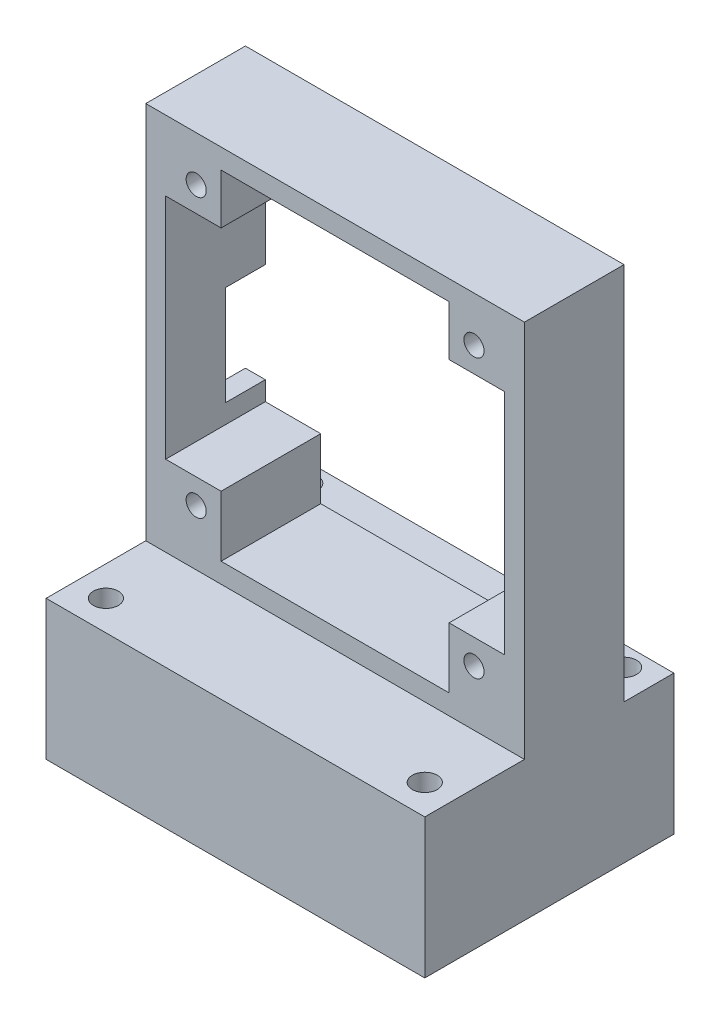
ISO-10303-21;
HEADER;
FILE_DESCRIPTION(('STEP AP214'),'2;1');
FILE_NAME('part.step','',(''),(''),'','','');
FILE_SCHEMA(('AUTOMOTIVE_DESIGN { 1 0 10303 214 1 1 1 1 }'));
ENDSEC;
DATA;
#1=APPLICATION_CONTEXT('core data for automotive mechanical design processes');
#2=APPLICATION_PROTOCOL_DEFINITION('international standard','automotive_design',2000,#1);
#3=PRODUCT_CONTEXT('',#1,'mechanical');
#4=PRODUCT('Part','Part','',(#3));
#5=PRODUCT_RELATED_PRODUCT_CATEGORY('part','',(#4));
#6=PRODUCT_DEFINITION_FORMATION('','',#4);
#7=PRODUCT_DEFINITION_CONTEXT('part definition',#1,'design');
#8=PRODUCT_DEFINITION('design','',#6,#7);
#9=PRODUCT_DEFINITION_SHAPE('','',#8);
#10=(LENGTH_UNIT() NAMED_UNIT(*) SI_UNIT(.MILLI.,.METRE.));
#11=(NAMED_UNIT(*) PLANE_ANGLE_UNIT() SI_UNIT($,.RADIAN.));
#12=(NAMED_UNIT(*) SI_UNIT($,.STERADIAN.) SOLID_ANGLE_UNIT());
#13=UNCERTAINTY_MEASURE_WITH_UNIT(LENGTH_MEASURE(1.E-05),#10,'distance_accuracy_value','');
#14=(GEOMETRIC_REPRESENTATION_CONTEXT(3) GLOBAL_UNCERTAINTY_ASSIGNED_CONTEXT((#13)) GLOBAL_UNIT_ASSIGNED_CONTEXT((#10,
#11,#12)) REPRESENTATION_CONTEXT('',''));
#15=CARTESIAN_POINT('',(0.,0.,0.));
#16=DIRECTION('',(0.,0.,1.));
#17=DIRECTION('',(1.,0.,0.));
#18=AXIS2_PLACEMENT_3D('',#15,#16,#17);
#19=CARTESIAN_POINT('',(0.,14.,0.));
#20=DIRECTION('',(0.,1.,0.));
#21=DIRECTION('',(0.,0.,1.));
#22=AXIS2_PLACEMENT_3D('',#19,#20,#21);
#23=PLANE('',#22);
#24=DIRECTION('',(1.,0.,0.));
#25=VECTOR('',#24,1.);
#26=CARTESIAN_POINT('',(-16.2857142857143,14.,-11.989417989418));
#27=LINE('',#26,#25);
#28=CARTESIAN_POINT('',(-16.2857142857143,14.,-11.989417989418));
#29=VERTEX_POINT('',#28);
#30=CARTESIAN_POINT('',(21.7142857142857,14.,-11.989417989418));
#31=VERTEX_POINT('',#30);
#32=EDGE_CURVE('E201',#29,#31,#27,.T.);
#33=ORIENTED_EDGE('',*,*,#32,.F.);
#34=DIRECTION('',(0.,0.,1.));
#35=VECTOR('',#34,1.);
#36=CARTESIAN_POINT('',(-16.2857142857143,14.,-16.989417989418));
#37=LINE('',#36,#35);
#38=CARTESIAN_POINT('',(-16.2857142857143,14.,-6.98941798941799));
#39=VERTEX_POINT('',#38);
#40=EDGE_CURVE('E210',#29,#39,#37,.T.);
#41=ORIENTED_EDGE('',*,*,#40,.T.);
#42=DIRECTION('',(-1.,0.,0.));
#43=VECTOR('',#42,1.);
#44=CARTESIAN_POINT('',(-16.2857142857142,14.,-6.98941798941799));
#45=LINE('',#44,#43);
#46=CARTESIAN_POINT('',(21.7142857142857,14.,-6.98941798941799));
#47=VERTEX_POINT('',#46);
#48=EDGE_CURVE('E478',#47,#39,#45,.T.);
#49=ORIENTED_EDGE('',*,*,#48,.F.);
#50=DIRECTION('',(0.,0.,-1.));
#51=VECTOR('',#50,1.);
#52=CARTESIAN_POINT('',(21.7142857142857,14.,-16.989417989418));
#53=LINE('',#52,#51);
#54=EDGE_CURVE('E213',#47,#31,#53,.T.);
#55=ORIENTED_EDGE('',*,*,#54,.T.);
#56=EDGE_LOOP('',(#33,#41,#49,#55));
#57=FACE_BOUND('',#56,.T.);
#58=CARTESIAN_POINT('',(18.7142857142857,14.,-9.98941798941799));
#59=DIRECTION('',(0.,1.,0.));
#60=DIRECTION('',(0.,0.,1.));
#61=AXIS2_PLACEMENT_3D('',#58,#59,#60);
#62=CIRCLE('',#61,1.25);
#63=CARTESIAN_POINT('',(18.7142857142857,14.,-8.73941798941799));
#64=VERTEX_POINT('',#63);
#65=EDGE_CURVE('E685',#64,#64,#62,.T.);
#66=ORIENTED_EDGE('',*,*,#65,.F.);
#67=EDGE_LOOP('',(#66));
#68=FACE_BOUND('',#67,.T.);
#69=CARTESIAN_POINT('',(-13.2857142857143,14.,-9.98941798941799));
#70=DIRECTION('',(0.,1.,0.));
#71=DIRECTION('',(0.,0.,1.));
#72=AXIS2_PLACEMENT_3D('',#69,#70,#71);
#73=CIRCLE('',#72,1.25);
#74=CARTESIAN_POINT('',(-13.2857142857143,14.,-8.73941798941799));
#75=VERTEX_POINT('',#74);
#76=EDGE_CURVE('E268',#75,#75,#73,.T.);
#77=ORIENTED_EDGE('',*,*,#76,.F.);
#78=EDGE_LOOP('',(#77));
#79=FACE_BOUND('',#78,.T.);
#80=ADVANCED_FACE('F39',(#57,#68,#79),#23,.T.);
#81=CARTESIAN_POINT('',(-16.2857142857143,14.,-16.989417989418));
#82=DIRECTION('',(1.,0.,0.));
#83=DIRECTION('',(0.,0.,-1.));
#84=AXIS2_PLACEMENT_3D('',#81,#82,#83);
#85=PLANE('',#84);
#86=ORIENTED_EDGE('',*,*,#40,.F.);
#87=DIRECTION('',(0.,1.,0.));
#88=VECTOR('',#87,1.);
#89=CARTESIAN_POINT('',(-16.2857142857143,-17.,-11.989417989418));
#90=LINE('',#89,#88);
#91=CARTESIAN_POINT('',(-16.2857142857143,0.,-11.989417989418));
#92=VERTEX_POINT('',#91);
#93=EDGE_CURVE('E198',#92,#29,#90,.T.);
#94=ORIENTED_EDGE('',*,*,#93,.F.);
#95=DIRECTION('',(0.,0.,1.));
#96=VECTOR('',#95,1.);
#97=CARTESIAN_POINT('',(-16.2857142857143,0.,-16.989417989418));
#98=LINE('',#97,#96);
#99=CARTESIAN_POINT('',(-16.2857142857143,0.,13.010582010582));
#100=VERTEX_POINT('',#99);
#101=EDGE_CURVE('E236',#92,#100,#98,.T.);
#102=ORIENTED_EDGE('',*,*,#101,.T.);
#103=DIRECTION('',(0.,-1.,0.));
#104=VECTOR('',#103,1.);
#105=CARTESIAN_POINT('',(-16.2857142857143,14.,13.010582010582));
#106=LINE('',#105,#104);
#107=CARTESIAN_POINT('',(-16.2857142857143,14.,13.010582010582));
#108=VERTEX_POINT('',#107);
#109=EDGE_CURVE('E248',#108,#100,#106,.T.);
#110=ORIENTED_EDGE('',*,*,#109,.F.);
#111=CARTESIAN_POINT('',(-16.2857142857143,14.,3.01058201058201));
#112=VERTEX_POINT('',#111);
#113=EDGE_CURVE('E222',#112,#108,#37,.T.);
#114=ORIENTED_EDGE('',*,*,#113,.F.);
#115=DIRECTION('',(0.,-1.,0.));
#116=VECTOR('',#115,1.);
#117=CARTESIAN_POINT('',(-16.2857142857143,52.,3.01058201058201));
#118=LINE('',#117,#116);
#119=CARTESIAN_POINT('',(-16.2857142857143,52.,3.01058201058201));
#120=VERTEX_POINT('',#119);
#121=EDGE_CURVE('E229',#120,#112,#118,.T.);
#122=ORIENTED_EDGE('',*,*,#121,.F.);
#123=DIRECTION('',(0.,0.,1.));
#124=VECTOR('',#123,1.);
#125=CARTESIAN_POINT('',(-16.2857142857142,52.,-6.98941798941799));
#126=LINE('',#125,#124);
#127=CARTESIAN_POINT('',(-16.2857142857142,52.,-6.98941798941799));
#128=VERTEX_POINT('',#127);
#129=EDGE_CURVE('E473',#128,#120,#126,.T.);
#130=ORIENTED_EDGE('',*,*,#129,.F.);
#131=DIRECTION('',(0.,-1.,0.));
#132=VECTOR('',#131,1.);
#133=CARTESIAN_POINT('',(-16.2857142857142,52.,-6.98941798941799));
#134=LINE('',#133,#132);
#135=CARTESIAN_POINT('',(-16.2857142857143,34.,-6.98941798941799));
#136=VERTEX_POINT('',#135);
#137=EDGE_CURVE('E492',#128,#136,#134,.T.);
#138=ORIENTED_EDGE('',*,*,#137,.T.);
#139=DIRECTION('',(0.,0.,-1.));
#140=VECTOR('',#139,1.);
#141=CARTESIAN_POINT('',(-16.2857142857143,34.,-6.98941798941799));
#142=LINE('',#141,#140);
#143=CARTESIAN_POINT('',(-16.2857142857143,34.,-2.98941798941799));
#144=VERTEX_POINT('',#143);
#145=EDGE_CURVE('E287',#144,#136,#142,.T.);
#146=ORIENTED_EDGE('',*,*,#145,.F.);
#147=DIRECTION('',(0.,1.,0.));
#148=VECTOR('',#147,1.);
#149=CARTESIAN_POINT('',(-16.2857142857143,34.,-2.98941798941799));
#150=LINE('',#149,#148);
#151=CARTESIAN_POINT('',(-16.2857142857143,24.,-2.98941798941799));
#152=VERTEX_POINT('',#151);
#153=EDGE_CURVE('E282',#152,#144,#150,.T.);
#154=ORIENTED_EDGE('',*,*,#153,.F.);
#155=DIRECTION('',(0.,0.,1.));
#156=VECTOR('',#155,1.);
#157=CARTESIAN_POINT('',(-16.2857142857143,24.,-6.98941798941799));
#158=LINE('',#157,#156);
#159=CARTESIAN_POINT('',(-16.2857142857143,24.,-6.98941798941799));
#160=VERTEX_POINT('',#159);
#161=EDGE_CURVE('E278',#160,#152,#158,.T.);
#162=ORIENTED_EDGE('',*,*,#161,.F.);
#163=EDGE_CURVE('E218',#160,#39,#134,.T.);
#164=ORIENTED_EDGE('',*,*,#163,.T.);
#165=EDGE_LOOP('',(#86,#94,#102,#110,#114,#122,#130,#138,#146,#154,#162,#164));
#166=FACE_BOUND('',#165,.T.);
#167=ADVANCED_FACE('F41',(#166),#85,.F.);
#168=CARTESIAN_POINT('',(-16.2857142857143,14.,13.010582010582));
#169=DIRECTION('',(0.,0.,-1.));
#170=DIRECTION('',(-1.,0.,0.));
#171=AXIS2_PLACEMENT_3D('',#168,#169,#170);
#172=PLANE('',#171);
#173=DIRECTION('',(1.,0.,0.));
#174=VECTOR('',#173,1.);
#175=CARTESIAN_POINT('',(-16.2857142857143,0.,13.010582010582));
#176=LINE('',#175,#174);
#177=CARTESIAN_POINT('',(21.7142857142857,0.,13.010582010582));
#178=VERTEX_POINT('',#177);
#179=EDGE_CURVE('E239',#100,#178,#176,.T.);
#180=ORIENTED_EDGE('',*,*,#179,.T.);
#181=DIRECTION('',(0.,-1.,0.));
#182=VECTOR('',#181,1.);
#183=CARTESIAN_POINT('',(21.7142857142857,14.,13.010582010582));
#184=LINE('',#183,#182);
#185=CARTESIAN_POINT('',(21.7142857142857,14.,13.010582010582));
#186=VERTEX_POINT('',#185);
#187=EDGE_CURVE('E235',#186,#178,#184,.T.);
#188=ORIENTED_EDGE('',*,*,#187,.F.);
#189=DIRECTION('',(1.,0.,0.));
#190=VECTOR('',#189,1.);
#191=CARTESIAN_POINT('',(-16.2857142857143,14.,13.010582010582));
#192=LINE('',#191,#190);
#193=EDGE_CURVE('E221',#108,#186,#192,.T.);
#194=ORIENTED_EDGE('',*,*,#193,.F.);
#195=ORIENTED_EDGE('',*,*,#109,.T.);
#196=EDGE_LOOP('',(#180,#188,#194,#195));
#197=FACE_BOUND('',#196,.T.);
#198=ADVANCED_FACE('F519',(#197),#172,.F.);
#199=CARTESIAN_POINT('',(21.7142857142857,14.,-16.989417989418));
#200=DIRECTION('',(-1.,0.,0.));
#201=DIRECTION('',(0.,0.,1.));
#202=AXIS2_PLACEMENT_3D('',#199,#200,#201);
#203=PLANE('',#202);
#204=DIRECTION('',(0.,0.,-1.));
#205=VECTOR('',#204,1.);
#206=CARTESIAN_POINT('',(21.7142857142857,0.,-16.989417989418));
#207=LINE('',#206,#205);
#208=CARTESIAN_POINT('',(21.7142857142857,0.,-11.989417989418));
#209=VERTEX_POINT('',#208);
#210=EDGE_CURVE('E227',#178,#209,#207,.T.);
#211=ORIENTED_EDGE('',*,*,#210,.T.);
#212=DIRECTION('',(0.,1.,0.));
#213=VECTOR('',#212,1.);
#214=CARTESIAN_POINT('',(21.7142857142857,-17.,-11.989417989418));
#215=LINE('',#214,#213);
#216=EDGE_CURVE('E55',#209,#31,#215,.T.);
#217=ORIENTED_EDGE('',*,*,#216,.T.);
#218=ORIENTED_EDGE('',*,*,#54,.F.);
#219=DIRECTION('',(0.,-1.,0.));
#220=VECTOR('',#219,1.);
#221=CARTESIAN_POINT('',(21.7142857142857,52.,-6.98941798941799));
#222=LINE('',#221,#220);
#223=CARTESIAN_POINT('',(21.7142857142857,52.,-6.98941798941799));
#224=VERTEX_POINT('',#223);
#225=EDGE_CURVE('E496',#224,#47,#222,.T.);
#226=ORIENTED_EDGE('',*,*,#225,.F.);
#227=DIRECTION('',(0.,0.,-1.));
#228=VECTOR('',#227,1.);
#229=CARTESIAN_POINT('',(21.7142857142857,52.,-6.98941798941799));
#230=LINE('',#229,#228);
#231=CARTESIAN_POINT('',(21.7142857142857,52.,3.01058201058201));
#232=VERTEX_POINT('',#231);
#233=EDGE_CURVE('E481',#232,#224,#230,.T.);
#234=ORIENTED_EDGE('',*,*,#233,.F.);
#235=DIRECTION('',(0.,-1.,0.));
#236=VECTOR('',#235,1.);
#237=CARTESIAN_POINT('',(21.7142857142857,52.,3.01058201058201));
#238=LINE('',#237,#236);
#239=CARTESIAN_POINT('',(21.7142857142857,14.,3.01058201058201));
#240=VERTEX_POINT('',#239);
#241=EDGE_CURVE('E499',#232,#240,#238,.T.);
#242=ORIENTED_EDGE('',*,*,#241,.T.);
#243=EDGE_CURVE('E232',#186,#240,#53,.T.);
#244=ORIENTED_EDGE('',*,*,#243,.F.);
#245=ORIENTED_EDGE('',*,*,#187,.T.);
#246=EDGE_LOOP('',(#211,#217,#218,#226,#234,#242,#244,#245));
#247=FACE_BOUND('',#246,.T.);
#248=ADVANCED_FACE('F522',(#247),#203,.F.);
#249=CARTESIAN_POINT('',(-13.2857142857143,14.,10.010582010582));
#250=DIRECTION('',(0.,1.,0.));
#251=DIRECTION('',(0.,0.,1.));
#252=AXIS2_PLACEMENT_3D('',#249,#250,#251);
#253=CIRCLE('',#252,1.25);
#254=CARTESIAN_POINT('',(-13.2857142857143,14.,11.260582010582));
#255=VERTEX_POINT('',#254);
#256=EDGE_CURVE('E679',#255,#255,#253,.T.);
#257=ORIENTED_EDGE('',*,*,#256,.F.);
#258=EDGE_LOOP('',(#257));
#259=FACE_BOUND('',#258,.T.);
#260=CARTESIAN_POINT('',(18.7142857142858,14.,10.010582010582));
#261=DIRECTION('',(0.,1.,0.));
#262=DIRECTION('',(0.,0.,1.));
#263=AXIS2_PLACEMENT_3D('',#260,#261,#262);
#264=CIRCLE('',#263,1.25);
#265=CARTESIAN_POINT('',(18.7142857142858,14.,11.260582010582));
#266=VERTEX_POINT('',#265);
#267=EDGE_CURVE('E683',#266,#266,#264,.T.);
#268=ORIENTED_EDGE('',*,*,#267,.F.);
#269=EDGE_LOOP('',(#268));
#270=FACE_BOUND('',#269,.T.);
#271=DIRECTION('',(1.,0.,0.));
#272=VECTOR('',#271,1.);
#273=CARTESIAN_POINT('',(-16.2857142857143,14.,3.01058201058201));
#274=LINE('',#273,#272);
#275=EDGE_CURVE('E472',#112,#240,#274,.T.);
#276=ORIENTED_EDGE('',*,*,#275,.F.);
#277=ORIENTED_EDGE('',*,*,#113,.T.);
#278=ORIENTED_EDGE('',*,*,#193,.T.);
#279=ORIENTED_EDGE('',*,*,#243,.T.);
#280=EDGE_LOOP('',(#276,#277,#278,#279));
#281=FACE_BOUND('',#280,.T.);
#282=ADVANCED_FACE('F516',(#259,#270,#281),#23,.T.);
#283=CARTESIAN_POINT('',(0.,0.,0.));
#284=DIRECTION('',(0.,1.,0.));
#285=DIRECTION('',(0.,0.,1.));
#286=AXIS2_PLACEMENT_3D('',#283,#284,#285);
#287=PLANE('',#286);
#288=CARTESIAN_POINT('',(-13.2857142857143,0.,10.010582010582));
#289=DIRECTION('',(0.,1.,0.));
#290=DIRECTION('',(0.,0.,1.));
#291=AXIS2_PLACEMENT_3D('',#288,#289,#290);
#292=CIRCLE('',#291,1.25);
#293=CARTESIAN_POINT('',(-13.2857142857143,0.,11.260582010582));
#294=VERTEX_POINT('',#293);
#295=EDGE_CURVE('E275',#294,#294,#292,.T.);
#296=ORIENTED_EDGE('',*,*,#295,.T.);
#297=EDGE_LOOP('',(#296));
#298=FACE_BOUND('',#297,.T.);
#299=CARTESIAN_POINT('',(18.7142857142858,0.,10.010582010582));
#300=DIRECTION('',(0.,1.,0.));
#301=DIRECTION('',(0.,0.,1.));
#302=AXIS2_PLACEMENT_3D('',#299,#300,#301);
#303=CIRCLE('',#302,1.25);
#304=CARTESIAN_POINT('',(18.7142857142858,0.,11.260582010582));
#305=VERTEX_POINT('',#304);
#306=EDGE_CURVE('E272',#305,#305,#303,.T.);
#307=ORIENTED_EDGE('',*,*,#306,.T.);
#308=EDGE_LOOP('',(#307));
#309=FACE_BOUND('',#308,.T.);
#310=CARTESIAN_POINT('',(18.7142857142857,0.,-9.98941798941799));
#311=DIRECTION('',(0.,1.,0.));
#312=DIRECTION('',(0.,0.,1.));
#313=AXIS2_PLACEMENT_3D('',#310,#311,#312);
#314=CIRCLE('',#313,1.25);
#315=CARTESIAN_POINT('',(18.7142857142857,0.,-8.73941798941799));
#316=VERTEX_POINT('',#315);
#317=EDGE_CURVE('E267',#316,#316,#314,.T.);
#318=ORIENTED_EDGE('',*,*,#317,.T.);
#319=EDGE_LOOP('',(#318));
#320=FACE_BOUND('',#319,.T.);
#321=CARTESIAN_POINT('',(-13.2857142857143,0.,-9.98941798941799));
#322=DIRECTION('',(0.,1.,0.));
#323=DIRECTION('',(0.,0.,1.));
#324=AXIS2_PLACEMENT_3D('',#321,#322,#323);
#325=CIRCLE('',#324,1.25);
#326=CARTESIAN_POINT('',(-13.2857142857143,0.,-8.73941798941799));
#327=VERTEX_POINT('',#326);
#328=EDGE_CURVE('E263',#327,#327,#325,.T.);
#329=ORIENTED_EDGE('',*,*,#328,.T.);
#330=EDGE_LOOP('',(#329));
#331=FACE_BOUND('',#330,.T.);
#332=ORIENTED_EDGE('',*,*,#101,.F.);
#333=DIRECTION('',(1.,0.,0.));
#334=VECTOR('',#333,1.);
#335=CARTESIAN_POINT('',(0.,0.,-11.989417989418));
#336=LINE('',#335,#334);
#337=EDGE_CURVE('E11',#92,#209,#336,.T.);
#338=ORIENTED_EDGE('',*,*,#337,.T.);
#339=ORIENTED_EDGE('',*,*,#210,.F.);
#340=ORIENTED_EDGE('',*,*,#179,.F.);
#341=EDGE_LOOP('',(#332,#338,#339,#340));
#342=FACE_BOUND('',#341,.T.);
#343=ADVANCED_FACE('F529',(#298,#309,#320,#331,#342),#287,.F.);
#344=CARTESIAN_POINT('',(-16.2857142857143,52.,3.01058201058201));
#345=DIRECTION('',(0.,0.,-1.));
#346=DIRECTION('',(-1.,0.,0.));
#347=AXIS2_PLACEMENT_3D('',#344,#345,#346);
#348=PLANE('',#347);
#349=DIRECTION('',(1.,0.,0.));
#350=VECTOR('',#349,1.);
#351=CARTESIAN_POINT('',(-16.2857142857143,50.,3.01058201058201));
#352=LINE('',#351,#350);
#353=CARTESIAN_POINT('',(-8.72571428571425,50.,3.01058201058201));
#354=VERTEX_POINT('',#353);
#355=CARTESIAN_POINT('',(14.1542857142857,50.,3.01058201058201));
#356=VERTEX_POINT('',#355);
#357=EDGE_CURVE('E432',#354,#356,#352,.T.);
#358=ORIENTED_EDGE('',*,*,#357,.T.);
#359=DIRECTION('',(0.,-1.,0.));
#360=VECTOR('',#359,1.);
#361=CARTESIAN_POINT('',(14.1542857142857,52.,3.01058201058201));
#362=LINE('',#361,#360);
#363=CARTESIAN_POINT('',(14.1542857142857,44.9666681823181,3.01058201058201));
#364=VERTEX_POINT('',#363);
#365=EDGE_CURVE('E436',#356,#364,#362,.T.);
#366=ORIENTED_EDGE('',*,*,#365,.T.);
#367=DIRECTION('',(1.,0.,0.));
#368=VECTOR('',#367,1.);
#369=CARTESIAN_POINT('',(-16.2857142857143,44.9666681823181,3.01058201058201));
#370=LINE('',#369,#368);
#371=CARTESIAN_POINT('',(19.7142857142858,44.9666681823181,3.01058201058201));
#372=VERTEX_POINT('',#371);
#373=EDGE_CURVE('E358',#364,#372,#370,.T.);
#374=ORIENTED_EDGE('',*,*,#373,.T.);
#375=DIRECTION('',(0.,-1.,0.));
#376=VECTOR('',#375,1.);
#377=CARTESIAN_POINT('',(19.7142857142858,52.,3.01058201058201));
#378=LINE('',#377,#376);
#379=CARTESIAN_POINT('',(19.7142857142857,22.0866681823181,3.01058201058201));
#380=VERTEX_POINT('',#379);
#381=EDGE_CURVE('E396',#372,#380,#378,.T.);
#382=ORIENTED_EDGE('',*,*,#381,.T.);
#383=DIRECTION('',(-1.,0.,0.));
#384=VECTOR('',#383,1.);
#385=CARTESIAN_POINT('',(-16.2857142857143,22.0866681823181,3.01058201058201));
#386=LINE('',#385,#384);
#387=CARTESIAN_POINT('',(14.1542857142857,22.0866681823181,3.01058201058201));
#388=VERTEX_POINT('',#387);
#389=EDGE_CURVE('E400',#380,#388,#386,.T.);
#390=ORIENTED_EDGE('',*,*,#389,.T.);
#391=DIRECTION('',(0.,-1.,0.));
#392=VECTOR('',#391,1.);
#393=CARTESIAN_POINT('',(14.1542857142857,52.,3.01058201058201));
#394=LINE('',#393,#392);
#395=CARTESIAN_POINT('',(14.1542857142858,16.,3.01058201058201));
#396=VERTEX_POINT('',#395);
#397=EDGE_CURVE('E404',#388,#396,#394,.T.);
#398=ORIENTED_EDGE('',*,*,#397,.T.);
#399=DIRECTION('',(-1.,0.,0.));
#400=VECTOR('',#399,1.);
#401=CARTESIAN_POINT('',(-16.2857142857143,16.,3.01058201058201));
#402=LINE('',#401,#400);
#403=CARTESIAN_POINT('',(-8.72571428571424,16.,3.01058201058201));
#404=VERTEX_POINT('',#403);
#405=EDGE_CURVE('E408',#396,#404,#402,.T.);
#406=ORIENTED_EDGE('',*,*,#405,.T.);
#407=DIRECTION('',(0.,1.,0.));
#408=VECTOR('',#407,1.);
#409=CARTESIAN_POINT('',(-8.72571428571425,52.,3.01058201058201));
#410=LINE('',#409,#408);
#411=CARTESIAN_POINT('',(-8.72571428571424,22.0866681823181,3.01058201058201));
#412=VERTEX_POINT('',#411);
#413=EDGE_CURVE('E412',#404,#412,#410,.T.);
#414=ORIENTED_EDGE('',*,*,#413,.T.);
#415=DIRECTION('',(-1.,0.,0.));
#416=VECTOR('',#415,1.);
#417=CARTESIAN_POINT('',(-16.2857142857143,22.0866681823181,3.01058201058201));
#418=LINE('',#417,#416);
#419=CARTESIAN_POINT('',(-14.2857142857143,22.0866681823181,3.01058201058201));
#420=VERTEX_POINT('',#419);
#421=EDGE_CURVE('E416',#412,#420,#418,.T.);
#422=ORIENTED_EDGE('',*,*,#421,.T.);
#423=DIRECTION('',(0.,1.,0.));
#424=VECTOR('',#423,1.);
#425=CARTESIAN_POINT('',(-14.2857142857143,52.,3.01058201058201));
#426=LINE('',#425,#424);
#427=CARTESIAN_POINT('',(-14.2857142857143,44.9666681823181,3.01058201058201));
#428=VERTEX_POINT('',#427);
#429=EDGE_CURVE('E420',#420,#428,#426,.T.);
#430=ORIENTED_EDGE('',*,*,#429,.T.);
#431=DIRECTION('',(1.,0.,0.));
#432=VECTOR('',#431,1.);
#433=CARTESIAN_POINT('',(-16.2857142857143,44.9666681823181,3.01058201058201));
#434=LINE('',#433,#432);
#435=CARTESIAN_POINT('',(-8.72571428571425,44.9666681823181,3.01058201058201));
#436=VERTEX_POINT('',#435);
#437=EDGE_CURVE('E424',#428,#436,#434,.T.);
#438=ORIENTED_EDGE('',*,*,#437,.T.);
#439=DIRECTION('',(0.,1.,0.));
#440=VECTOR('',#439,1.);
#441=CARTESIAN_POINT('',(-8.72571428571425,52.,3.01058201058201));
#442=LINE('',#441,#440);
#443=EDGE_CURVE('E428',#436,#354,#442,.T.);
#444=ORIENTED_EDGE('',*,*,#443,.T.);
#445=EDGE_LOOP('',(#358,#366,#374,#382,#390,#398,#406,#414,#422,#430,#438,#444));
#446=FACE_BOUND('',#445,.T.);
#447=CARTESIAN_POINT('',(-11.2257142857142,47.4666681823181,3.01058201058201));
#448=DIRECTION('',(0.,0.,-1.));
#449=DIRECTION('',(-1.,0.,0.));
#450=AXIS2_PLACEMENT_3D('',#447,#448,#449);
#451=CIRCLE('',#450,1.01);
#452=CARTESIAN_POINT('',(-12.2357142857142,47.4666681823181,3.01058201058201));
#453=VERTEX_POINT('',#452);
#454=EDGE_CURVE('E468',#453,#453,#451,.T.);
#455=ORIENTED_EDGE('',*,*,#454,.T.);
#456=EDGE_LOOP('',(#455));
#457=FACE_BOUND('',#456,.T.);
#458=CARTESIAN_POINT('',(16.6542857142858,19.5866681823181,3.01058201058201));
#459=DIRECTION('',(0.,0.,-1.));
#460=DIRECTION('',(-1.,0.,0.));
#461=AXIS2_PLACEMENT_3D('',#458,#459,#460);
#462=CIRCLE('',#461,1.01);
#463=CARTESIAN_POINT('',(15.6442857142858,19.5866681823181,3.01058201058201));
#464=VERTEX_POINT('',#463);
#465=EDGE_CURVE('E464',#464,#464,#462,.T.);
#466=ORIENTED_EDGE('',*,*,#465,.T.);
#467=EDGE_LOOP('',(#466));
#468=FACE_BOUND('',#467,.T.);
#469=CARTESIAN_POINT('',(-11.2257142857142,19.5866681823181,3.01058201058201));
#470=DIRECTION('',(0.,0.,-1.));
#471=DIRECTION('',(-1.,0.,0.));
#472=AXIS2_PLACEMENT_3D('',#469,#470,#471);
#473=CIRCLE('',#472,1.01);
#474=CARTESIAN_POINT('',(-12.2357142857142,19.5866681823181,3.01058201058201));
#475=VERTEX_POINT('',#474);
#476=EDGE_CURVE('E460',#475,#475,#473,.T.);
#477=ORIENTED_EDGE('',*,*,#476,.T.);
#478=EDGE_LOOP('',(#477));
#479=FACE_BOUND('',#478,.T.);
#480=CARTESIAN_POINT('',(16.6542857142857,47.4666681823181,3.01058201058201));
#481=DIRECTION('',(0.,0.,-1.));
#482=DIRECTION('',(-1.,0.,0.));
#483=AXIS2_PLACEMENT_3D('',#480,#481,#482);
#484=CIRCLE('',#483,1.01);
#485=CARTESIAN_POINT('',(15.6442857142857,47.4666681823181,3.01058201058201));
#486=VERTEX_POINT('',#485);
#487=EDGE_CURVE('E456',#486,#486,#484,.T.);
#488=ORIENTED_EDGE('',*,*,#487,.T.);
#489=EDGE_LOOP('',(#488));
#490=FACE_BOUND('',#489,.T.);
#491=ORIENTED_EDGE('',*,*,#275,.T.);
#492=ORIENTED_EDGE('',*,*,#241,.F.);
#493=DIRECTION('',(1.,0.,0.));
#494=VECTOR('',#493,1.);
#495=CARTESIAN_POINT('',(-16.2857142857143,52.,3.01058201058201));
#496=LINE('',#495,#494);
#497=EDGE_CURVE('E477',#120,#232,#496,.T.);
#498=ORIENTED_EDGE('',*,*,#497,.F.);
#499=ORIENTED_EDGE('',*,*,#121,.T.);
#500=EDGE_LOOP('',(#491,#492,#498,#499));
#501=FACE_BOUND('',#500,.T.);
#502=ADVANCED_FACE('F510',(#446,#457,#468,#479,#490,#501),#348,.F.);
#503=CARTESIAN_POINT('',(-16.2857142857142,52.,-6.98941798941799));
#504=DIRECTION('',(0.,0.,1.));
#505=DIRECTION('',(1.,0.,0.));
#506=AXIS2_PLACEMENT_3D('',#503,#504,#505);
#507=PLANE('',#506);
#508=CARTESIAN_POINT('',(-11.2257142857142,47.4666681823181,-6.98941798941799));
#509=DIRECTION('',(0.,0.,-1.));
#510=DIRECTION('',(-1.,0.,0.));
#511=AXIS2_PLACEMENT_3D('',#508,#509,#510);
#512=CIRCLE('',#511,1.01);
#513=CARTESIAN_POINT('',(-12.2357142857142,47.4666681823181,-6.98941798941799));
#514=VERTEX_POINT('',#513);
#515=EDGE_CURVE('E445',#514,#514,#512,.T.);
#516=ORIENTED_EDGE('',*,*,#515,.F.);
#517=EDGE_LOOP('',(#516));
#518=FACE_BOUND('',#517,.T.);
#519=CARTESIAN_POINT('',(16.6542857142858,19.5866681823181,-6.98941798941799));
#520=DIRECTION('',(0.,0.,-1.));
#521=DIRECTION('',(-1.,0.,0.));
#522=AXIS2_PLACEMENT_3D('',#519,#520,#521);
#523=CIRCLE('',#522,1.01);
#524=CARTESIAN_POINT('',(15.6442857142858,19.5866681823181,-6.98941798941799));
#525=VERTEX_POINT('',#524);
#526=EDGE_CURVE('E444',#525,#525,#523,.T.);
#527=ORIENTED_EDGE('',*,*,#526,.F.);
#528=EDGE_LOOP('',(#527));
#529=FACE_BOUND('',#528,.T.);
#530=CARTESIAN_POINT('',(-11.2257142857142,19.5866681823181,-6.98941798941799));
#531=DIRECTION('',(0.,0.,-1.));
#532=DIRECTION('',(-1.,0.,0.));
#533=AXIS2_PLACEMENT_3D('',#530,#531,#532);
#534=CIRCLE('',#533,1.01);
#535=CARTESIAN_POINT('',(-12.2357142857142,19.5866681823181,-6.98941798941799));
#536=VERTEX_POINT('',#535);
#537=EDGE_CURVE('E440',#536,#536,#534,.T.);
#538=ORIENTED_EDGE('',*,*,#537,.F.);
#539=EDGE_LOOP('',(#538));
#540=FACE_BOUND('',#539,.T.);
#541=CARTESIAN_POINT('',(16.6542857142857,47.4666681823181,-6.98941798941799));
#542=DIRECTION('',(0.,0.,-1.));
#543=DIRECTION('',(-1.,0.,0.));
#544=AXIS2_PLACEMENT_3D('',#541,#542,#543);
#545=CIRCLE('',#544,1.01);
#546=CARTESIAN_POINT('',(15.6442857142857,47.4666681823181,-6.98941798941799));
#547=VERTEX_POINT('',#546);
#548=EDGE_CURVE('E449',#547,#547,#545,.T.);
#549=ORIENTED_EDGE('',*,*,#548,.F.);
#550=EDGE_LOOP('',(#549));
#551=FACE_BOUND('',#550,.T.);
#552=DIRECTION('',(0.,1.,0.));
#553=VECTOR('',#552,1.);
#554=CARTESIAN_POINT('',(-14.2857142857143,44.9666681823181,-6.98941798941799));
#555=LINE('',#554,#553);
#556=CARTESIAN_POINT('',(-14.2857142857143,34.,-6.98941798941799));
#557=VERTEX_POINT('',#556);
#558=CARTESIAN_POINT('',(-14.2857142857143,44.9666681823181,-6.98941798941799));
#559=VERTEX_POINT('',#558);
#560=EDGE_CURVE('E334',#557,#559,#555,.T.);
#561=ORIENTED_EDGE('',*,*,#560,.F.);
#562=DIRECTION('',(-1.,0.,0.));
#563=VECTOR('',#562,1.);
#564=CARTESIAN_POINT('',(-4.28571428571428,34.,-6.98941798941799));
#565=LINE('',#564,#563);
#566=EDGE_CURVE('E295',#557,#136,#565,.T.);
#567=ORIENTED_EDGE('',*,*,#566,.T.);
#568=ORIENTED_EDGE('',*,*,#137,.F.);
#569=DIRECTION('',(-1.,0.,0.));
#570=VECTOR('',#569,1.);
#571=CARTESIAN_POINT('',(-16.2857142857142,52.,-6.98941798941799));
#572=LINE('',#571,#570);
#573=EDGE_CURVE('E484',#224,#128,#572,.T.);
#574=ORIENTED_EDGE('',*,*,#573,.F.);
#575=ORIENTED_EDGE('',*,*,#225,.T.);
#576=ORIENTED_EDGE('',*,*,#48,.T.);
#577=ORIENTED_EDGE('',*,*,#163,.F.);
#578=DIRECTION('',(-1.,0.,0.));
#579=VECTOR('',#578,1.);
#580=CARTESIAN_POINT('',(-4.28571428571428,24.,-6.98941798941799));
#581=LINE('',#580,#579);
#582=CARTESIAN_POINT('',(-14.2857142857143,24.,-6.98941798941799));
#583=VERTEX_POINT('',#582);
#584=EDGE_CURVE('E294',#583,#160,#581,.T.);
#585=ORIENTED_EDGE('',*,*,#584,.F.);
#586=CARTESIAN_POINT('',(-14.2857142857143,22.0866681823181,-6.98941798941799));
#587=VERTEX_POINT('',#586);
#588=EDGE_CURVE('E335',#587,#583,#555,.T.);
#589=ORIENTED_EDGE('',*,*,#588,.F.);
#590=DIRECTION('',(-1.,0.,0.));
#591=VECTOR('',#590,1.);
#592=CARTESIAN_POINT('',(-14.2857142857143,22.0866681823181,-6.98941798941799));
#593=LINE('',#592,#591);
#594=CARTESIAN_POINT('',(-8.72571428571424,22.0866681823181,-6.98941798941799));
#595=VERTEX_POINT('',#594);
#596=EDGE_CURVE('E330',#595,#587,#593,.T.);
#597=ORIENTED_EDGE('',*,*,#596,.F.);
#598=DIRECTION('',(0.,1.,0.));
#599=VECTOR('',#598,1.);
#600=CARTESIAN_POINT('',(-8.72571428571424,22.0866681823181,-6.98941798941799));
#601=LINE('',#600,#599);
#602=CARTESIAN_POINT('',(-8.72571428571424,16.,-6.98941798941799));
#603=VERTEX_POINT('',#602);
#604=EDGE_CURVE('E326',#603,#595,#601,.T.);
#605=ORIENTED_EDGE('',*,*,#604,.F.);
#606=DIRECTION('',(-1.,0.,0.));
#607=VECTOR('',#606,1.);
#608=CARTESIAN_POINT('',(-8.72571428571424,16.,-6.98941798941799));
#609=LINE('',#608,#607);
#610=CARTESIAN_POINT('',(14.1542857142858,16.,-6.98941798941799));
#611=VERTEX_POINT('',#610);
#612=EDGE_CURVE('E322',#611,#603,#609,.T.);
#613=ORIENTED_EDGE('',*,*,#612,.F.);
#614=DIRECTION('',(0.,-1.,0.));
#615=VECTOR('',#614,1.);
#616=CARTESIAN_POINT('',(14.1542857142858,16.,-6.98941798941799));
#617=LINE('',#616,#615);
#618=CARTESIAN_POINT('',(14.1542857142857,22.0866681823181,-6.98941798941799));
#619=VERTEX_POINT('',#618);
#620=EDGE_CURVE('E318',#619,#611,#617,.T.);
#621=ORIENTED_EDGE('',*,*,#620,.F.);
#622=DIRECTION('',(-1.,0.,0.));
#623=VECTOR('',#622,1.);
#624=CARTESIAN_POINT('',(14.1542857142857,22.0866681823181,-6.98941798941799));
#625=LINE('',#624,#623);
#626=CARTESIAN_POINT('',(19.7142857142857,22.0866681823181,-6.98941798941799));
#627=VERTEX_POINT('',#626);
#628=EDGE_CURVE('E314',#627,#619,#625,.T.);
#629=ORIENTED_EDGE('',*,*,#628,.F.);
#630=DIRECTION('',(0.,-1.,0.));
#631=VECTOR('',#630,1.);
#632=CARTESIAN_POINT('',(19.7142857142857,22.0866681823181,-6.98941798941799));
#633=LINE('',#632,#631);
#634=CARTESIAN_POINT('',(19.7142857142857,44.9666681823181,-6.98941798941799));
#635=VERTEX_POINT('',#634);
#636=EDGE_CURVE('E310',#635,#627,#633,.T.);
#637=ORIENTED_EDGE('',*,*,#636,.F.);
#638=DIRECTION('',(1.,0.,0.));
#639=VECTOR('',#638,1.);
#640=CARTESIAN_POINT('',(19.7142857142857,44.9666681823181,-6.98941798941799));
#641=LINE('',#640,#639);
#642=CARTESIAN_POINT('',(14.1542857142858,44.9666681823181,-6.98941798941799));
#643=VERTEX_POINT('',#642);
#644=EDGE_CURVE('E299',#643,#635,#641,.T.);
#645=ORIENTED_EDGE('',*,*,#644,.F.);
#646=DIRECTION('',(0.,-1.,0.));
#647=VECTOR('',#646,1.);
#648=CARTESIAN_POINT('',(14.1542857142857,47.3968124735477,-6.98941798941799));
#649=LINE('',#648,#647);
#650=CARTESIAN_POINT('',(14.1542857142857,50.,-6.98941798941799));
#651=VERTEX_POINT('',#650);
#652=EDGE_CURVE('E351',#651,#643,#649,.T.);
#653=ORIENTED_EDGE('',*,*,#652,.F.);
#654=DIRECTION('',(1.,0.,0.));
#655=VECTOR('',#654,1.);
#656=CARTESIAN_POINT('',(14.1542857142857,50.,-6.98941798941799));
#657=LINE('',#656,#655);
#658=CARTESIAN_POINT('',(-8.72571428571425,50.,-6.98941798941799));
#659=VERTEX_POINT('',#658);
#660=EDGE_CURVE('E347',#659,#651,#657,.T.);
#661=ORIENTED_EDGE('',*,*,#660,.F.);
#662=DIRECTION('',(0.,1.,0.));
#663=VECTOR('',#662,1.);
#664=CARTESIAN_POINT('',(-8.72571428571425,50.,-6.98941798941799));
#665=LINE('',#664,#663);
#666=CARTESIAN_POINT('',(-8.72571428571425,44.9666681823181,-6.98941798941799));
#667=VERTEX_POINT('',#666);
#668=EDGE_CURVE('E343',#667,#659,#665,.T.);
#669=ORIENTED_EDGE('',*,*,#668,.F.);
#670=DIRECTION('',(1.,0.,0.));
#671=VECTOR('',#670,1.);
#672=CARTESIAN_POINT('',(-8.72571428571425,44.9666681823181,-6.98941798941799));
#673=LINE('',#672,#671);
#674=EDGE_CURVE('E339',#559,#667,#673,.T.);
#675=ORIENTED_EDGE('',*,*,#674,.F.);
#676=EDGE_LOOP('',(#561,#567,#568,#574,#575,#576,#577,#585,#589,#597,#605,#613,#621,#629,#637,
#645,#653,#661,#669,#675));
#677=FACE_BOUND('',#676,.T.);
#678=ADVANCED_FACE('F543',(#518,#529,#540,#551,#677),#507,.F.);
#679=CARTESIAN_POINT('',(0.,52.,0.));
#680=DIRECTION('',(0.,1.,0.));
#681=DIRECTION('',(0.,0.,1.));
#682=AXIS2_PLACEMENT_3D('',#679,#680,#681);
#683=PLANE('',#682);
#684=ORIENTED_EDGE('',*,*,#129,.T.);
#685=ORIENTED_EDGE('',*,*,#497,.T.);
#686=ORIENTED_EDGE('',*,*,#233,.T.);
#687=ORIENTED_EDGE('',*,*,#573,.T.);
#688=EDGE_LOOP('',(#684,#685,#686,#687));
#689=FACE_BOUND('',#688,.T.);
#690=ADVANCED_FACE('F643',(#689),#683,.T.);
#691=CARTESIAN_POINT('',(16.6542857142857,47.4666681823181,31.010582010582));
#692=DIRECTION('',(0.,0.,-1.));
#693=DIRECTION('',(-1.,0.,0.));
#694=AXIS2_PLACEMENT_3D('',#691,#692,#693);
#695=CYLINDRICAL_SURFACE('',#694,1.01);
#696=ORIENTED_EDGE('',*,*,#548,.T.);
#697=EDGE_LOOP('',(#696));
#698=FACE_BOUND('',#697,.T.);
#699=ORIENTED_EDGE('',*,*,#487,.F.);
#700=EDGE_LOOP('',(#699));
#701=FACE_BOUND('',#700,.T.);
#702=ADVANCED_FACE('F633',(#698,#701),#695,.F.);
#703=CARTESIAN_POINT('',(-11.2257142857142,19.5866681823181,31.010582010582));
#704=DIRECTION('',(0.,0.,-1.));
#705=DIRECTION('',(-1.,0.,0.));
#706=AXIS2_PLACEMENT_3D('',#703,#704,#705);
#707=CYLINDRICAL_SURFACE('',#706,1.01);
#708=ORIENTED_EDGE('',*,*,#537,.T.);
#709=EDGE_LOOP('',(#708));
#710=FACE_BOUND('',#709,.T.);
#711=ORIENTED_EDGE('',*,*,#476,.F.);
#712=EDGE_LOOP('',(#711));
#713=FACE_BOUND('',#712,.T.);
#714=ADVANCED_FACE('F629',(#710,#713),#707,.F.);
#715=CARTESIAN_POINT('',(16.6542857142858,19.5866681823181,31.010582010582));
#716=DIRECTION('',(0.,0.,-1.));
#717=DIRECTION('',(-1.,0.,0.));
#718=AXIS2_PLACEMENT_3D('',#715,#716,#717);
#719=CYLINDRICAL_SURFACE('',#718,1.01);
#720=ORIENTED_EDGE('',*,*,#526,.T.);
#721=EDGE_LOOP('',(#720));
#722=FACE_BOUND('',#721,.T.);
#723=ORIENTED_EDGE('',*,*,#465,.F.);
#724=EDGE_LOOP('',(#723));
#725=FACE_BOUND('',#724,.T.);
#726=ADVANCED_FACE('F632',(#722,#725),#719,.F.);
#727=CARTESIAN_POINT('',(-11.2257142857142,47.4666681823181,31.010582010582));
#728=DIRECTION('',(0.,0.,-1.));
#729=DIRECTION('',(-1.,0.,0.));
#730=AXIS2_PLACEMENT_3D('',#727,#728,#729);
#731=CYLINDRICAL_SURFACE('',#730,1.01);
#732=ORIENTED_EDGE('',*,*,#515,.T.);
#733=EDGE_LOOP('',(#732));
#734=FACE_BOUND('',#733,.T.);
#735=ORIENTED_EDGE('',*,*,#454,.F.);
#736=EDGE_LOOP('',(#735));
#737=FACE_BOUND('',#736,.T.);
#738=ADVANCED_FACE('F585',(#734,#737),#731,.F.);
#739=CARTESIAN_POINT('',(14.1542857142857,47.3968124735477,31.010582010582));
#740=DIRECTION('',(1.,0.,0.));
#741=DIRECTION('',(0.,0.,-1.));
#742=AXIS2_PLACEMENT_3D('',#739,#740,#741);
#743=PLANE('',#742);
#744=DIRECTION('',(0.,0.,-1.));
#745=VECTOR('',#744,1.);
#746=CARTESIAN_POINT('',(14.1542857142857,50.,31.010582010582));
#747=LINE('',#746,#745);
#748=EDGE_CURVE('E355',#356,#651,#747,.T.);
#749=ORIENTED_EDGE('',*,*,#748,.T.);
#750=ORIENTED_EDGE('',*,*,#652,.T.);
#751=DIRECTION('',(0.,0.,-1.));
#752=VECTOR('',#751,1.);
#753=CARTESIAN_POINT('',(14.1542857142857,44.9666681823181,31.010582010582));
#754=LINE('',#753,#752);
#755=EDGE_CURVE('E354',#364,#643,#754,.T.);
#756=ORIENTED_EDGE('',*,*,#755,.F.);
#757=ORIENTED_EDGE('',*,*,#365,.F.);
#758=EDGE_LOOP('',(#749,#750,#756,#757));
#759=FACE_BOUND('',#758,.T.);
#760=ADVANCED_FACE('F581',(#759),#743,.F.);
#761=CARTESIAN_POINT('',(14.1542857142857,50.,31.010582010582));
#762=DIRECTION('',(0.,1.,0.));
#763=DIRECTION('',(0.,0.,1.));
#764=AXIS2_PLACEMENT_3D('',#761,#762,#763);
#765=PLANE('',#764);
#766=DIRECTION('',(0.,0.,-1.));
#767=VECTOR('',#766,1.);
#768=CARTESIAN_POINT('',(-8.72571428571425,50.,31.010582010582));
#769=LINE('',#768,#767);
#770=EDGE_CURVE('E359',#354,#659,#769,.T.);
#771=ORIENTED_EDGE('',*,*,#770,.T.);
#772=ORIENTED_EDGE('',*,*,#660,.T.);
#773=ORIENTED_EDGE('',*,*,#748,.F.);
#774=ORIENTED_EDGE('',*,*,#357,.F.);
#775=EDGE_LOOP('',(#771,#772,#773,#774));
#776=FACE_BOUND('',#775,.T.);
#777=ADVANCED_FACE('F584',(#776),#765,.F.);
#778=CARTESIAN_POINT('',(-8.72571428571425,50.,31.010582010582));
#779=DIRECTION('',(-1.,0.,0.));
#780=DIRECTION('',(0.,-1.,0.));
#781=AXIS2_PLACEMENT_3D('',#778,#779,#780);
#782=PLANE('',#781);
#783=DIRECTION('',(0.,0.,-1.));
#784=VECTOR('',#783,1.);
#785=CARTESIAN_POINT('',(-8.72571428571425,44.9666681823181,31.010582010582));
#786=LINE('',#785,#784);
#787=EDGE_CURVE('E362',#436,#667,#786,.T.);
#788=ORIENTED_EDGE('',*,*,#787,.T.);
#789=ORIENTED_EDGE('',*,*,#668,.T.);
#790=ORIENTED_EDGE('',*,*,#770,.F.);
#791=ORIENTED_EDGE('',*,*,#443,.F.);
#792=EDGE_LOOP('',(#788,#789,#790,#791));
#793=FACE_BOUND('',#792,.T.);
#794=ADVANCED_FACE('F589',(#793),#782,.F.);
#795=CARTESIAN_POINT('',(-8.72571428571425,44.9666681823181,31.010582010582));
#796=DIRECTION('',(0.,1.,0.));
#797=DIRECTION('',(0.,0.,1.));
#798=AXIS2_PLACEMENT_3D('',#795,#796,#797);
#799=PLANE('',#798);
#800=DIRECTION('',(0.,0.,-1.));
#801=VECTOR('',#800,1.);
#802=CARTESIAN_POINT('',(-14.2857142857143,44.9666681823181,31.010582010582));
#803=LINE('',#802,#801);
#804=EDGE_CURVE('E365',#428,#559,#803,.T.);
#805=ORIENTED_EDGE('',*,*,#804,.T.);
#806=ORIENTED_EDGE('',*,*,#674,.T.);
#807=ORIENTED_EDGE('',*,*,#787,.F.);
#808=ORIENTED_EDGE('',*,*,#437,.F.);
#809=EDGE_LOOP('',(#805,#806,#807,#808));
#810=FACE_BOUND('',#809,.T.);
#811=ADVANCED_FACE('F593',(#810),#799,.F.);
#812=CARTESIAN_POINT('',(-14.2857142857143,44.9666681823181,31.010582010582));
#813=DIRECTION('',(-1.,0.,0.));
#814=DIRECTION('',(0.,-1.,0.));
#815=AXIS2_PLACEMENT_3D('',#812,#813,#814);
#816=PLANE('',#815);
#817=DIRECTION('',(0.,1.,0.));
#818=VECTOR('',#817,1.);
#819=CARTESIAN_POINT('',(-14.2857142857143,44.9666681823181,-2.989417989418));
#820=LINE('',#819,#818);
#821=CARTESIAN_POINT('',(-14.2857142857143,24.,-2.989417989418));
#822=VERTEX_POINT('',#821);
#823=CARTESIAN_POINT('',(-14.2857142857143,34.,-2.98941798941799));
#824=VERTEX_POINT('',#823);
#825=EDGE_CURVE('E256',#822,#824,#820,.T.);
#826=ORIENTED_EDGE('',*,*,#825,.T.);
#827=DIRECTION('',(0.,0.,-1.));
#828=VECTOR('',#827,1.);
#829=CARTESIAN_POINT('',(-14.2857142857143,34.,31.010582010582));
#830=LINE('',#829,#828);
#831=EDGE_CURVE('E48',#824,#557,#830,.T.);
#832=ORIENTED_EDGE('',*,*,#831,.T.);
#833=ORIENTED_EDGE('',*,*,#560,.T.);
#834=ORIENTED_EDGE('',*,*,#804,.F.);
#835=ORIENTED_EDGE('',*,*,#429,.F.);
#836=DIRECTION('',(0.,0.,-1.));
#837=VECTOR('',#836,1.);
#838=CARTESIAN_POINT('',(-14.2857142857143,22.0866681823181,31.010582010582));
#839=LINE('',#838,#837);
#840=EDGE_CURVE('E369',#420,#587,#839,.T.);
#841=ORIENTED_EDGE('',*,*,#840,.T.);
#842=ORIENTED_EDGE('',*,*,#588,.T.);
#843=DIRECTION('',(0.,0.,1.));
#844=VECTOR('',#843,1.);
#845=CARTESIAN_POINT('',(-14.2857142857143,24.,31.010582010582));
#846=LINE('',#845,#844);
#847=EDGE_CURVE('E252',#583,#822,#846,.T.);
#848=ORIENTED_EDGE('',*,*,#847,.T.);
#849=EDGE_LOOP('',(#826,#832,#833,#834,#835,#841,#842,#848));
#850=FACE_BOUND('',#849,.T.);
#851=ADVANCED_FACE('F597',(#850),#816,.F.);
#852=CARTESIAN_POINT('',(-14.2857142857143,22.0866681823181,31.010582010582));
#853=DIRECTION('',(0.,-1.,0.));
#854=DIRECTION('',(0.,0.,-1.));
#855=AXIS2_PLACEMENT_3D('',#852,#853,#854);
#856=PLANE('',#855);
#857=DIRECTION('',(0.,0.,-1.));
#858=VECTOR('',#857,1.);
#859=CARTESIAN_POINT('',(-8.72571428571424,22.0866681823181,31.010582010582));
#860=LINE('',#859,#858);
#861=EDGE_CURVE('E372',#412,#595,#860,.T.);
#862=ORIENTED_EDGE('',*,*,#861,.T.);
#863=ORIENTED_EDGE('',*,*,#596,.T.);
#864=ORIENTED_EDGE('',*,*,#840,.F.);
#865=ORIENTED_EDGE('',*,*,#421,.F.);
#866=EDGE_LOOP('',(#862,#863,#864,#865));
#867=FACE_BOUND('',#866,.T.);
#868=ADVANCED_FACE('F601',(#867),#856,.F.);
#869=CARTESIAN_POINT('',(-8.72571428571424,22.0866681823181,31.010582010582));
#870=DIRECTION('',(-1.,0.,0.));
#871=DIRECTION('',(0.,-1.,0.));
#872=AXIS2_PLACEMENT_3D('',#869,#870,#871);
#873=PLANE('',#872);
#874=DIRECTION('',(0.,0.,-1.));
#875=VECTOR('',#874,1.);
#876=CARTESIAN_POINT('',(-8.72571428571424,16.,31.010582010582));
#877=LINE('',#876,#875);
#878=EDGE_CURVE('E375',#404,#603,#877,.T.);
#879=ORIENTED_EDGE('',*,*,#878,.T.);
#880=ORIENTED_EDGE('',*,*,#604,.T.);
#881=ORIENTED_EDGE('',*,*,#861,.F.);
#882=ORIENTED_EDGE('',*,*,#413,.F.);
#883=EDGE_LOOP('',(#879,#880,#881,#882));
#884=FACE_BOUND('',#883,.T.);
#885=ADVANCED_FACE('F605',(#884),#873,.F.);
#886=CARTESIAN_POINT('',(-8.72571428571424,16.,31.010582010582));
#887=DIRECTION('',(0.,-1.,0.));
#888=DIRECTION('',(1.,0.,0.));
#889=AXIS2_PLACEMENT_3D('',#886,#887,#888);
#890=PLANE('',#889);
#891=DIRECTION('',(0.,0.,-1.));
#892=VECTOR('',#891,1.);
#893=CARTESIAN_POINT('',(14.1542857142858,16.,31.010582010582));
#894=LINE('',#893,#892);
#895=EDGE_CURVE('E378',#396,#611,#894,.T.);
#896=ORIENTED_EDGE('',*,*,#895,.T.);
#897=ORIENTED_EDGE('',*,*,#612,.T.);
#898=ORIENTED_EDGE('',*,*,#878,.F.);
#899=ORIENTED_EDGE('',*,*,#405,.F.);
#900=EDGE_LOOP('',(#896,#897,#898,#899));
#901=FACE_BOUND('',#900,.T.);
#902=ADVANCED_FACE('F609',(#901),#890,.F.);
#903=CARTESIAN_POINT('',(14.1542857142858,16.,31.010582010582));
#904=DIRECTION('',(1.,0.,0.));
#905=DIRECTION('',(0.,1.,0.));
#906=AXIS2_PLACEMENT_3D('',#903,#904,#905);
#907=PLANE('',#906);
#908=DIRECTION('',(0.,0.,-1.));
#909=VECTOR('',#908,1.);
#910=CARTESIAN_POINT('',(14.1542857142857,22.0866681823181,31.010582010582));
#911=LINE('',#910,#909);
#912=EDGE_CURVE('E381',#388,#619,#911,.T.);
#913=ORIENTED_EDGE('',*,*,#912,.T.);
#914=ORIENTED_EDGE('',*,*,#620,.T.);
#915=ORIENTED_EDGE('',*,*,#895,.F.);
#916=ORIENTED_EDGE('',*,*,#397,.F.);
#917=EDGE_LOOP('',(#913,#914,#915,#916));
#918=FACE_BOUND('',#917,.T.);
#919=ADVANCED_FACE('F613',(#918),#907,.F.);
#920=CARTESIAN_POINT('',(14.1542857142857,22.0866681823181,31.010582010582));
#921=DIRECTION('',(0.,-1.,0.));
#922=DIRECTION('',(0.,0.,-1.));
#923=AXIS2_PLACEMENT_3D('',#920,#921,#922);
#924=PLANE('',#923);
#925=DIRECTION('',(0.,0.,-1.));
#926=VECTOR('',#925,1.);
#927=CARTESIAN_POINT('',(19.7142857142857,22.0866681823181,31.010582010582));
#928=LINE('',#927,#926);
#929=EDGE_CURVE('E384',#380,#627,#928,.T.);
#930=ORIENTED_EDGE('',*,*,#929,.T.);
#931=ORIENTED_EDGE('',*,*,#628,.T.);
#932=ORIENTED_EDGE('',*,*,#912,.F.);
#933=ORIENTED_EDGE('',*,*,#389,.F.);
#934=EDGE_LOOP('',(#930,#931,#932,#933));
#935=FACE_BOUND('',#934,.T.);
#936=ADVANCED_FACE('F617',(#935),#924,.F.);
#937=CARTESIAN_POINT('',(19.7142857142857,22.0866681823181,31.010582010582));
#938=DIRECTION('',(1.,0.,0.));
#939=DIRECTION('',(0.,0.,-1.));
#940=AXIS2_PLACEMENT_3D('',#937,#938,#939);
#941=PLANE('',#940);
#942=DIRECTION('',(0.,0.,-1.));
#943=VECTOR('',#942,1.);
#944=CARTESIAN_POINT('',(19.7142857142857,44.9666681823181,31.010582010582));
#945=LINE('',#944,#943);
#946=EDGE_CURVE('E387',#372,#635,#945,.T.);
#947=ORIENTED_EDGE('',*,*,#946,.T.);
#948=ORIENTED_EDGE('',*,*,#636,.T.);
#949=ORIENTED_EDGE('',*,*,#929,.F.);
#950=ORIENTED_EDGE('',*,*,#381,.F.);
#951=EDGE_LOOP('',(#947,#948,#949,#950));
#952=FACE_BOUND('',#951,.T.);
#953=ADVANCED_FACE('F621',(#952),#941,.F.);
#954=CARTESIAN_POINT('',(19.7142857142857,44.9666681823181,31.010582010582));
#955=DIRECTION('',(0.,1.,0.));
#956=DIRECTION('',(0.,0.,1.));
#957=AXIS2_PLACEMENT_3D('',#954,#955,#956);
#958=PLANE('',#957);
#959=ORIENTED_EDGE('',*,*,#755,.T.);
#960=ORIENTED_EDGE('',*,*,#644,.T.);
#961=ORIENTED_EDGE('',*,*,#946,.F.);
#962=ORIENTED_EDGE('',*,*,#373,.F.);
#963=EDGE_LOOP('',(#959,#960,#961,#962));
#964=FACE_BOUND('',#963,.T.);
#965=ADVANCED_FACE('F576',(#964),#958,.F.);
#966=CARTESIAN_POINT('',(-4.28571428571428,34.,-6.98941798941799));
#967=DIRECTION('',(0.,1.,0.));
#968=DIRECTION('',(0.,0.,1.));
#969=AXIS2_PLACEMENT_3D('',#966,#967,#968);
#970=PLANE('',#969);
#971=DIRECTION('',(-1.,0.,0.));
#972=VECTOR('',#971,1.);
#973=CARTESIAN_POINT('',(-4.28571428571428,34.,-2.98941798941799));
#974=LINE('',#973,#972);
#975=EDGE_CURVE('E300',#824,#144,#974,.T.);
#976=ORIENTED_EDGE('',*,*,#975,.T.);
#977=ORIENTED_EDGE('',*,*,#145,.T.);
#978=ORIENTED_EDGE('',*,*,#566,.F.);
#979=ORIENTED_EDGE('',*,*,#831,.F.);
#980=EDGE_LOOP('',(#976,#977,#978,#979));
#981=FACE_BOUND('',#980,.T.);
#982=ADVANCED_FACE('F573',(#981),#970,.F.);
#983=CARTESIAN_POINT('',(-4.28571428571428,34.,-2.98941798941799));
#984=DIRECTION('',(0.,0.,1.));
#985=DIRECTION('',(0.,-1.,0.));
#986=AXIS2_PLACEMENT_3D('',#983,#984,#985);
#987=PLANE('',#986);
#988=DIRECTION('',(-1.,0.,0.));
#989=VECTOR('',#988,1.);
#990=CARTESIAN_POINT('',(-4.28571428571428,24.,-2.98941798941799));
#991=LINE('',#990,#989);
#992=EDGE_CURVE('E62',#822,#152,#991,.T.);
#993=ORIENTED_EDGE('',*,*,#992,.T.);
#994=ORIENTED_EDGE('',*,*,#153,.T.);
#995=ORIENTED_EDGE('',*,*,#975,.F.);
#996=ORIENTED_EDGE('',*,*,#825,.F.);
#997=EDGE_LOOP('',(#993,#994,#995,#996));
#998=FACE_BOUND('',#997,.T.);
#999=ADVANCED_FACE('F566',(#998),#987,.F.);
#1000=CARTESIAN_POINT('',(-4.28571428571428,24.,-6.98941798941799));
#1001=DIRECTION('',(0.,-1.,0.));
#1002=DIRECTION('',(0.,0.,-1.));
#1003=AXIS2_PLACEMENT_3D('',#1000,#1001,#1002);
#1004=PLANE('',#1003);
#1005=ORIENTED_EDGE('',*,*,#584,.T.);
#1006=ORIENTED_EDGE('',*,*,#161,.T.);
#1007=ORIENTED_EDGE('',*,*,#992,.F.);
#1008=ORIENTED_EDGE('',*,*,#847,.F.);
#1009=EDGE_LOOP('',(#1005,#1006,#1007,#1008));
#1010=FACE_BOUND('',#1009,.T.);
#1011=ADVANCED_FACE('F556',(#1010),#1004,.F.);
#1012=CARTESIAN_POINT('',(-13.2857142857143,-17.,-9.98941798941799));
#1013=DIRECTION('',(0.,1.,0.));
#1014=DIRECTION('',(0.,0.,1.));
#1015=AXIS2_PLACEMENT_3D('',#1012,#1013,#1014);
#1016=CYLINDRICAL_SURFACE('',#1015,1.25);
#1017=ORIENTED_EDGE('',*,*,#76,.T.);
#1018=EDGE_LOOP('',(#1017));
#1019=FACE_BOUND('',#1018,.T.);
#1020=ORIENTED_EDGE('',*,*,#328,.F.);
#1021=EDGE_LOOP('',(#1020));
#1022=FACE_BOUND('',#1021,.T.);
#1023=ADVANCED_FACE('F553',(#1019,#1022),#1016,.F.);
#1024=CARTESIAN_POINT('',(18.7142857142857,-17.,-9.98941798941799));
#1025=DIRECTION('',(0.,1.,0.));
#1026=DIRECTION('',(0.,0.,1.));
#1027=AXIS2_PLACEMENT_3D('',#1024,#1025,#1026);
#1028=CYLINDRICAL_SURFACE('',#1027,1.25);
#1029=ORIENTED_EDGE('',*,*,#65,.T.);
#1030=EDGE_LOOP('',(#1029));
#1031=FACE_BOUND('',#1030,.T.);
#1032=ORIENTED_EDGE('',*,*,#317,.F.);
#1033=EDGE_LOOP('',(#1032));
#1034=FACE_BOUND('',#1033,.T.);
#1035=ADVANCED_FACE('F555',(#1031,#1034),#1028,.F.);
#1036=CARTESIAN_POINT('',(18.7142857142858,-17.,10.010582010582));
#1037=DIRECTION('',(0.,1.,0.));
#1038=DIRECTION('',(0.,0.,1.));
#1039=AXIS2_PLACEMENT_3D('',#1036,#1037,#1038);
#1040=CYLINDRICAL_SURFACE('',#1039,1.25);
#1041=ORIENTED_EDGE('',*,*,#267,.T.);
#1042=EDGE_LOOP('',(#1041));
#1043=FACE_BOUND('',#1042,.T.);
#1044=ORIENTED_EDGE('',*,*,#306,.F.);
#1045=EDGE_LOOP('',(#1044));
#1046=FACE_BOUND('',#1045,.T.);
#1047=ADVANCED_FACE('F563',(#1043,#1046),#1040,.F.);
#1048=CARTESIAN_POINT('',(-13.2857142857143,-17.,10.010582010582));
#1049=DIRECTION('',(0.,1.,0.));
#1050=DIRECTION('',(0.,0.,1.));
#1051=AXIS2_PLACEMENT_3D('',#1048,#1049,#1050);
#1052=CYLINDRICAL_SURFACE('',#1051,1.25);
#1053=ORIENTED_EDGE('',*,*,#256,.T.);
#1054=EDGE_LOOP('',(#1053));
#1055=FACE_BOUND('',#1054,.T.);
#1056=ORIENTED_EDGE('',*,*,#295,.F.);
#1057=EDGE_LOOP('',(#1056));
#1058=FACE_BOUND('',#1057,.T.);
#1059=ADVANCED_FACE('F571',(#1055,#1058),#1052,.F.);
#1060=CARTESIAN_POINT('',(-16.2857142857143,-17.,-11.989417989418));
#1061=DIRECTION('',(0.,0.,1.));
#1062=DIRECTION('',(1.,0.,0.));
#1063=AXIS2_PLACEMENT_3D('',#1060,#1061,#1062);
#1064=PLANE('',#1063);
#1065=ORIENTED_EDGE('',*,*,#93,.T.);
#1066=ORIENTED_EDGE('',*,*,#32,.T.);
#1067=ORIENTED_EDGE('',*,*,#216,.F.);
#1068=ORIENTED_EDGE('',*,*,#337,.F.);
#1069=EDGE_LOOP('',(#1065,#1066,#1067,#1068));
#1070=FACE_BOUND('',#1069,.T.);
#1071=ADVANCED_FACE('F200',(#1070),#1064,.F.);
#1072=CLOSED_SHELL('',(#80,#167,#198,#248,#282,#343,#502,#678,#690,#702,#714,#726,#738,#760,
#777,#794,#811,#851,#868,#885,#902,#919,#936,#953,#965,#982,#999,#1011,#1023,#1035,#1047,#1059,#1071));
#1073=MANIFOLD_SOLID_BREP('B2',#1072);
#1074=ADVANCED_BREP_SHAPE_REPRESENTATION('',(#18,#1073),#14);
#1075=SHAPE_DEFINITION_REPRESENTATION(#9,#1074);
ENDSEC;
END-ISO-10303-21;
